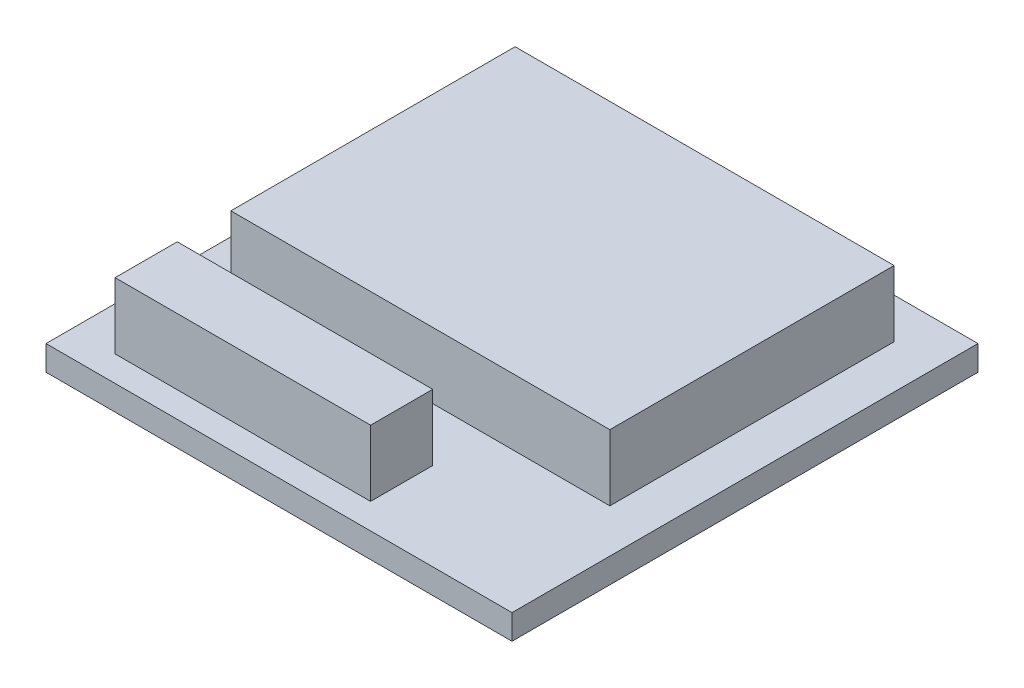
ISO-10303-21;
HEADER;
FILE_DESCRIPTION(('STEP AP214'),'2;1');
FILE_NAME('part.step','',(''),(''),'','','');
FILE_SCHEMA(('AUTOMOTIVE_DESIGN { 1 0 10303 214 1 1 1 1 }'));
ENDSEC;
DATA;
#1=APPLICATION_CONTEXT('core data for automotive mechanical design processes');
#2=APPLICATION_PROTOCOL_DEFINITION('international standard','automotive_design',2000,#1);
#3=PRODUCT_CONTEXT('',#1,'mechanical');
#4=PRODUCT('Part','Part','',(#3));
#5=PRODUCT_RELATED_PRODUCT_CATEGORY('part','',(#4));
#6=PRODUCT_DEFINITION_FORMATION('','',#4);
#7=PRODUCT_DEFINITION_CONTEXT('part definition',#1,'design');
#8=PRODUCT_DEFINITION('design','',#6,#7);
#9=PRODUCT_DEFINITION_SHAPE('','',#8);
#10=(LENGTH_UNIT() NAMED_UNIT(*) SI_UNIT(.MILLI.,.METRE.));
#11=(NAMED_UNIT(*) PLANE_ANGLE_UNIT() SI_UNIT($,.RADIAN.));
#12=(NAMED_UNIT(*) SI_UNIT($,.STERADIAN.) SOLID_ANGLE_UNIT());
#13=UNCERTAINTY_MEASURE_WITH_UNIT(LENGTH_MEASURE(1.E-05),#10,'distance_accuracy_value','');
#14=(GEOMETRIC_REPRESENTATION_CONTEXT(3) GLOBAL_UNCERTAINTY_ASSIGNED_CONTEXT((#13)) GLOBAL_UNIT_ASSIGNED_CONTEXT((#10,
#11,#12)) REPRESENTATION_CONTEXT('',''));
#15=CARTESIAN_POINT('',(0.,0.,0.));
#16=DIRECTION('',(0.,0.,1.));
#17=DIRECTION('',(1.,0.,0.));
#18=AXIS2_PLACEMENT_3D('',#15,#16,#17);
#19=CARTESIAN_POINT('',(2.15841157418595,2.9718,6.78293654824832));
#20=DIRECTION('',(-1.,0.,0.));
#21=DIRECTION('',(0.,0.,1.));
#22=AXIS2_PLACEMENT_3D('',#19,#20,#21);
#23=PLANE('',#22);
#24=DIRECTION('',(0.,0.,-1.));
#25=VECTOR('',#24,1.);
#26=CARTESIAN_POINT('',(2.15841157418595,0.8128,6.78293654824832));
#27=LINE('',#26,#25);
#28=CARTESIAN_POINT('',(2.15841157418595,0.8128,6.78293654824832));
#29=VERTEX_POINT('',#28);
#30=CARTESIAN_POINT('',(2.15841157418595,0.8128,4.75093654824832));
#31=VERTEX_POINT('',#30);
#32=EDGE_CURVE('E109',#29,#31,#27,.T.);
#33=ORIENTED_EDGE('',*,*,#32,.T.);
#34=DIRECTION('',(0.,-1.,0.));
#35=VECTOR('',#34,1.);
#36=CARTESIAN_POINT('',(2.15841157418595,2.9718,4.75093654824832));
#37=LINE('',#36,#35);
#38=CARTESIAN_POINT('',(2.15841157418595,2.9718,4.75093654824832));
#39=VERTEX_POINT('',#38);
#40=EDGE_CURVE('E12',#39,#31,#37,.T.);
#41=ORIENTED_EDGE('',*,*,#40,.F.);
#42=DIRECTION('',(0.,0.,-1.));
#43=VECTOR('',#42,1.);
#44=CARTESIAN_POINT('',(2.15841157418595,2.9718,6.78293654824832));
#45=LINE('',#44,#43);
#46=CARTESIAN_POINT('',(2.15841157418595,2.9718,6.78293654824832));
#47=VERTEX_POINT('',#46);
#48=EDGE_CURVE('E97',#47,#39,#45,.T.);
#49=ORIENTED_EDGE('',*,*,#48,.F.);
#50=DIRECTION('',(0.,-1.,0.));
#51=VECTOR('',#50,1.);
#52=CARTESIAN_POINT('',(2.15841157418595,2.9718,6.78293654824832));
#53=LINE('',#52,#51);
#54=EDGE_CURVE('E105',#47,#29,#53,.T.);
#55=ORIENTED_EDGE('',*,*,#54,.T.);
#56=EDGE_LOOP('',(#33,#41,#49,#55));
#57=FACE_BOUND('',#56,.T.);
#58=ADVANCED_FACE('F46',(#57),#23,.F.);
#59=CARTESIAN_POINT('',(-6.1976,2.9718,4.75093654824832));
#60=DIRECTION('',(0.,0.,1.));
#61=DIRECTION('',(1.,0.,0.));
#62=AXIS2_PLACEMENT_3D('',#59,#60,#61);
#63=PLANE('',#62);
#64=DIRECTION('',(-1.,0.,0.));
#65=VECTOR('',#64,1.);
#66=CARTESIAN_POINT('',(-6.1976,0.8128,4.75093654824832));
#67=LINE('',#66,#65);
#68=CARTESIAN_POINT('',(-6.1976,0.8128,4.75093654824832));
#69=VERTEX_POINT('',#68);
#70=EDGE_CURVE('E101',#31,#69,#67,.T.);
#71=ORIENTED_EDGE('',*,*,#70,.T.);
#72=DIRECTION('',(0.,-1.,0.));
#73=VECTOR('',#72,1.);
#74=CARTESIAN_POINT('',(-6.1976,2.9718,4.75093654824832));
#75=LINE('',#74,#73);
#76=CARTESIAN_POINT('',(-6.1976,2.9718,4.75093654824832));
#77=VERTEX_POINT('',#76);
#78=EDGE_CURVE('E54',#77,#69,#75,.T.);
#79=ORIENTED_EDGE('',*,*,#78,.F.);
#80=DIRECTION('',(-1.,0.,0.));
#81=VECTOR('',#80,1.);
#82=CARTESIAN_POINT('',(-6.1976,2.9718,4.75093654824832));
#83=LINE('',#82,#81);
#84=EDGE_CURVE('E92',#39,#77,#83,.T.);
#85=ORIENTED_EDGE('',*,*,#84,.F.);
#86=ORIENTED_EDGE('',*,*,#40,.T.);
#87=EDGE_LOOP('',(#71,#79,#85,#86));
#88=FACE_BOUND('',#87,.T.);
#89=ADVANCED_FACE('F100',(#88),#63,.F.);
#90=CARTESIAN_POINT('',(-6.1976,2.9718,6.78293654824832));
#91=DIRECTION('',(1.,0.,0.));
#92=DIRECTION('',(0.,0.,-1.));
#93=AXIS2_PLACEMENT_3D('',#90,#91,#92);
#94=PLANE('',#93);
#95=DIRECTION('',(0.,0.,1.));
#96=VECTOR('',#95,1.);
#97=CARTESIAN_POINT('',(-6.1976,0.8128,6.78293654824832));
#98=LINE('',#97,#96);
#99=CARTESIAN_POINT('',(-6.1976,0.8128,6.78293654824832));
#100=VERTEX_POINT('',#99);
#101=EDGE_CURVE('E79',#69,#100,#98,.T.);
#102=ORIENTED_EDGE('',*,*,#101,.T.);
#103=DIRECTION('',(0.,-1.,0.));
#104=VECTOR('',#103,1.);
#105=CARTESIAN_POINT('',(-6.1976,2.9718,6.78293654824832));
#106=LINE('',#105,#104);
#107=CARTESIAN_POINT('',(-6.1976,2.9718,6.78293654824832));
#108=VERTEX_POINT('',#107);
#109=EDGE_CURVE('E102',#108,#100,#106,.T.);
#110=ORIENTED_EDGE('',*,*,#109,.F.);
#111=DIRECTION('',(0.,0.,1.));
#112=VECTOR('',#111,1.);
#113=CARTESIAN_POINT('',(-6.1976,2.9718,6.78293654824832));
#114=LINE('',#113,#112);
#115=EDGE_CURVE('E95',#77,#108,#114,.T.);
#116=ORIENTED_EDGE('',*,*,#115,.F.);
#117=ORIENTED_EDGE('',*,*,#78,.T.);
#118=EDGE_LOOP('',(#102,#110,#116,#117));
#119=FACE_BOUND('',#118,.T.);
#120=ADVANCED_FACE('F103',(#119),#94,.F.);
#121=CARTESIAN_POINT('',(-6.1976,2.9718,6.78293654824832));
#122=DIRECTION('',(0.,0.,-1.));
#123=DIRECTION('',(-1.,0.,0.));
#124=AXIS2_PLACEMENT_3D('',#121,#122,#123);
#125=PLANE('',#124);
#126=DIRECTION('',(1.,0.,0.));
#127=VECTOR('',#126,1.);
#128=CARTESIAN_POINT('',(-6.1976,0.8128,6.78293654824832));
#129=LINE('',#128,#127);
#130=EDGE_CURVE('E85',#100,#29,#129,.T.);
#131=ORIENTED_EDGE('',*,*,#130,.T.);
#132=ORIENTED_EDGE('',*,*,#54,.F.);
#133=DIRECTION('',(1.,0.,0.));
#134=VECTOR('',#133,1.);
#135=CARTESIAN_POINT('',(-6.1976,2.9718,6.78293654824832));
#136=LINE('',#135,#134);
#137=EDGE_CURVE('E62',#108,#47,#136,.T.);
#138=ORIENTED_EDGE('',*,*,#137,.F.);
#139=ORIENTED_EDGE('',*,*,#109,.T.);
#140=EDGE_LOOP('',(#131,#132,#138,#139));
#141=FACE_BOUND('',#140,.T.);
#142=ADVANCED_FACE('F116',(#141),#125,.F.);
#143=CARTESIAN_POINT('',(2.15841157418595,2.9718,4.75093654824832));
#144=DIRECTION('',(0.,-1.,0.));
#145=DIRECTION('',(0.,0.,-1.));
#146=AXIS2_PLACEMENT_3D('',#143,#144,#145);
#147=PLANE('',#146);
#148=ORIENTED_EDGE('',*,*,#48,.T.);
#149=ORIENTED_EDGE('',*,*,#84,.T.);
#150=ORIENTED_EDGE('',*,*,#115,.T.);
#151=ORIENTED_EDGE('',*,*,#137,.T.);
#152=EDGE_LOOP('',(#148,#149,#150,#151));
#153=FACE_BOUND('',#152,.T.);
#154=ADVANCED_FACE('F93',(#153),#147,.F.);
#155=CARTESIAN_POINT('',(2.15841157418595,0.8128,4.75093654824832));
#156=DIRECTION('',(0.,-1.,0.));
#157=DIRECTION('',(0.,0.,-1.));
#158=AXIS2_PLACEMENT_3D('',#155,#156,#157);
#159=PLANE('',#158);
#160=ORIENTED_EDGE('',*,*,#32,.F.);
#161=ORIENTED_EDGE('',*,*,#130,.F.);
#162=ORIENTED_EDGE('',*,*,#101,.F.);
#163=ORIENTED_EDGE('',*,*,#70,.F.);
#164=EDGE_LOOP('',(#160,#161,#162,#163));
#165=FACE_BOUND('',#164,.T.);
#166=ADVANCED_FACE('F119',(#165),#159,.T.);
#167=CLOSED_SHELL('',(#58,#89,#120,#142,#154,#166));
#168=MANIFOLD_SOLID_BREP('B2',#167);
#169=CARTESIAN_POINT('',(6.1976,2.9718,-6.2992));
#170=DIRECTION('',(-1.,0.,0.));
#171=DIRECTION('',(0.,0.,1.));
#172=AXIS2_PLACEMENT_3D('',#169,#170,#171);
#173=PLANE('',#172);
#174=DIRECTION('',(0.,0.,-1.));
#175=VECTOR('',#174,1.);
#176=CARTESIAN_POINT('',(6.1976,0.8128,-6.2992));
#177=LINE('',#176,#175);
#178=CARTESIAN_POINT('',(6.1976,0.8128,2.9972));
#179=VERTEX_POINT('',#178);
#180=CARTESIAN_POINT('',(6.1976,0.8128,-6.2992));
#181=VERTEX_POINT('',#180);
#182=EDGE_CURVE('E252',#179,#181,#177,.T.);
#183=ORIENTED_EDGE('',*,*,#182,.T.);
#184=DIRECTION('',(0.,-1.,0.));
#185=VECTOR('',#184,1.);
#186=CARTESIAN_POINT('',(6.1976,2.9718,-6.2992));
#187=LINE('',#186,#185);
#188=CARTESIAN_POINT('',(6.1976,2.9718,-6.2992));
#189=VERTEX_POINT('',#188);
#190=EDGE_CURVE('E44',#189,#181,#187,.T.);
#191=ORIENTED_EDGE('',*,*,#190,.F.);
#192=DIRECTION('',(0.,0.,-1.));
#193=VECTOR('',#192,1.);
#194=CARTESIAN_POINT('',(6.1976,2.9718,-6.2992));
#195=LINE('',#194,#193);
#196=CARTESIAN_POINT('',(6.1976,2.9718,2.9972));
#197=VERTEX_POINT('',#196);
#198=EDGE_CURVE('E240',#197,#189,#195,.T.);
#199=ORIENTED_EDGE('',*,*,#198,.F.);
#200=DIRECTION('',(0.,-1.,0.));
#201=VECTOR('',#200,1.);
#202=CARTESIAN_POINT('',(6.1976,2.9718,2.9972));
#203=LINE('',#202,#201);
#204=EDGE_CURVE('E248',#197,#179,#203,.T.);
#205=ORIENTED_EDGE('',*,*,#204,.T.);
#206=EDGE_LOOP('',(#183,#191,#199,#205));
#207=FACE_BOUND('',#206,.T.);
#208=ADVANCED_FACE('F189',(#207),#173,.F.);
#209=CARTESIAN_POINT('',(-6.1976,2.9718,-6.2992));
#210=DIRECTION('',(0.,0.,1.));
#211=DIRECTION('',(1.,0.,0.));
#212=AXIS2_PLACEMENT_3D('',#209,#210,#211);
#213=PLANE('',#212);
#214=DIRECTION('',(-1.,0.,0.));
#215=VECTOR('',#214,1.);
#216=CARTESIAN_POINT('',(-6.1976,0.8128,-6.2992));
#217=LINE('',#216,#215);
#218=CARTESIAN_POINT('',(-6.1976,0.8128,-6.2992));
#219=VERTEX_POINT('',#218);
#220=EDGE_CURVE('E244',#181,#219,#217,.T.);
#221=ORIENTED_EDGE('',*,*,#220,.T.);
#222=DIRECTION('',(0.,-1.,0.));
#223=VECTOR('',#222,1.);
#224=CARTESIAN_POINT('',(-6.1976,2.9718,-6.2992));
#225=LINE('',#224,#223);
#226=CARTESIAN_POINT('',(-6.1976,2.9718,-6.2992));
#227=VERTEX_POINT('',#226);
#228=EDGE_CURVE('E197',#227,#219,#225,.T.);
#229=ORIENTED_EDGE('',*,*,#228,.F.);
#230=DIRECTION('',(-1.,0.,0.));
#231=VECTOR('',#230,1.);
#232=CARTESIAN_POINT('',(-6.1976,2.9718,-6.2992));
#233=LINE('',#232,#231);
#234=EDGE_CURVE('E235',#189,#227,#233,.T.);
#235=ORIENTED_EDGE('',*,*,#234,.F.);
#236=ORIENTED_EDGE('',*,*,#190,.T.);
#237=EDGE_LOOP('',(#221,#229,#235,#236));
#238=FACE_BOUND('',#237,.T.);
#239=ADVANCED_FACE('F243',(#238),#213,.F.);
#240=CARTESIAN_POINT('',(-6.1976,2.9718,-6.2992));
#241=DIRECTION('',(1.,0.,0.));
#242=DIRECTION('',(0.,0.,-1.));
#243=AXIS2_PLACEMENT_3D('',#240,#241,#242);
#244=PLANE('',#243);
#245=DIRECTION('',(0.,0.,1.));
#246=VECTOR('',#245,1.);
#247=CARTESIAN_POINT('',(-6.1976,0.8128,-6.2992));
#248=LINE('',#247,#246);
#249=CARTESIAN_POINT('',(-6.1976,0.8128,2.9972));
#250=VERTEX_POINT('',#249);
#251=EDGE_CURVE('E222',#219,#250,#248,.T.);
#252=ORIENTED_EDGE('',*,*,#251,.T.);
#253=DIRECTION('',(0.,-1.,0.));
#254=VECTOR('',#253,1.);
#255=CARTESIAN_POINT('',(-6.1976,2.9718,2.9972));
#256=LINE('',#255,#254);
#257=CARTESIAN_POINT('',(-6.1976,2.9718,2.9972));
#258=VERTEX_POINT('',#257);
#259=EDGE_CURVE('E245',#258,#250,#256,.T.);
#260=ORIENTED_EDGE('',*,*,#259,.F.);
#261=DIRECTION('',(0.,0.,1.));
#262=VECTOR('',#261,1.);
#263=CARTESIAN_POINT('',(-6.1976,2.9718,-6.2992));
#264=LINE('',#263,#262);
#265=EDGE_CURVE('E238',#227,#258,#264,.T.);
#266=ORIENTED_EDGE('',*,*,#265,.F.);
#267=ORIENTED_EDGE('',*,*,#228,.T.);
#268=EDGE_LOOP('',(#252,#260,#266,#267));
#269=FACE_BOUND('',#268,.T.);
#270=ADVANCED_FACE('F246',(#269),#244,.F.);
#271=CARTESIAN_POINT('',(-6.1976,2.9718,2.9972));
#272=DIRECTION('',(0.,0.,-1.));
#273=DIRECTION('',(-1.,0.,0.));
#274=AXIS2_PLACEMENT_3D('',#271,#272,#273);
#275=PLANE('',#274);
#276=DIRECTION('',(1.,0.,0.));
#277=VECTOR('',#276,1.);
#278=CARTESIAN_POINT('',(-6.1976,0.8128,2.9972));
#279=LINE('',#278,#277);
#280=EDGE_CURVE('E228',#250,#179,#279,.T.);
#281=ORIENTED_EDGE('',*,*,#280,.T.);
#282=ORIENTED_EDGE('',*,*,#204,.F.);
#283=DIRECTION('',(1.,0.,0.));
#284=VECTOR('',#283,1.);
#285=CARTESIAN_POINT('',(-6.1976,2.9718,2.9972));
#286=LINE('',#285,#284);
#287=EDGE_CURVE('E205',#258,#197,#286,.T.);
#288=ORIENTED_EDGE('',*,*,#287,.F.);
#289=ORIENTED_EDGE('',*,*,#259,.T.);
#290=EDGE_LOOP('',(#281,#282,#288,#289));
#291=FACE_BOUND('',#290,.T.);
#292=ADVANCED_FACE('F259',(#291),#275,.F.);
#293=CARTESIAN_POINT('',(6.1976,2.9718,2.9972));
#294=DIRECTION('',(0.,1.,0.));
#295=DIRECTION('',(0.,0.,1.));
#296=AXIS2_PLACEMENT_3D('',#293,#294,#295);
#297=PLANE('',#296);
#298=ORIENTED_EDGE('',*,*,#198,.T.);
#299=ORIENTED_EDGE('',*,*,#234,.T.);
#300=ORIENTED_EDGE('',*,*,#265,.T.);
#301=ORIENTED_EDGE('',*,*,#287,.T.);
#302=EDGE_LOOP('',(#298,#299,#300,#301));
#303=FACE_BOUND('',#302,.T.);
#304=ADVANCED_FACE('F236',(#303),#297,.T.);
#305=CARTESIAN_POINT('',(6.1976,0.8128,2.9972));
#306=DIRECTION('',(0.,1.,0.));
#307=DIRECTION('',(0.,0.,1.));
#308=AXIS2_PLACEMENT_3D('',#305,#306,#307);
#309=PLANE('',#308);
#310=ORIENTED_EDGE('',*,*,#182,.F.);
#311=ORIENTED_EDGE('',*,*,#280,.F.);
#312=ORIENTED_EDGE('',*,*,#251,.F.);
#313=ORIENTED_EDGE('',*,*,#220,.F.);
#314=EDGE_LOOP('',(#310,#311,#312,#313));
#315=FACE_BOUND('',#314,.T.);
#316=ADVANCED_FACE('F262',(#315),#309,.F.);
#317=CLOSED_SHELL('',(#208,#239,#270,#292,#304,#316));
#318=MANIFOLD_SOLID_BREP('B6',#317);
#319=CARTESIAN_POINT('',(7.62,0.8128,7.62));
#320=DIRECTION('',(-1.,0.,0.));
#321=DIRECTION('',(0.,0.,1.));
#322=AXIS2_PLACEMENT_3D('',#319,#320,#321);
#323=PLANE('',#322);
#324=DIRECTION('',(0.,0.,-1.));
#325=VECTOR('',#324,1.);
#326=CARTESIAN_POINT('',(7.62,0.,7.62));
#327=LINE('',#326,#325);
#328=CARTESIAN_POINT('',(7.62,0.,7.62));
#329=VERTEX_POINT('',#328);
#330=CARTESIAN_POINT('',(7.62,0.,-7.62));
#331=VERTEX_POINT('',#330);
#332=EDGE_CURVE('E386',#329,#331,#327,.T.);
#333=ORIENTED_EDGE('',*,*,#332,.T.);
#334=DIRECTION('',(0.,-1.,0.));
#335=VECTOR('',#334,1.);
#336=CARTESIAN_POINT('',(7.62,0.8128,-7.62));
#337=LINE('',#336,#335);
#338=CARTESIAN_POINT('',(7.62,0.8128,-7.62));
#339=VERTEX_POINT('',#338);
#340=EDGE_CURVE('E187',#339,#331,#337,.T.);
#341=ORIENTED_EDGE('',*,*,#340,.F.);
#342=DIRECTION('',(0.,0.,-1.));
#343=VECTOR('',#342,1.);
#344=CARTESIAN_POINT('',(7.62,0.8128,7.62));
#345=LINE('',#344,#343);
#346=CARTESIAN_POINT('',(7.62,0.8128,7.62));
#347=VERTEX_POINT('',#346);
#348=EDGE_CURVE('E374',#347,#339,#345,.T.);
#349=ORIENTED_EDGE('',*,*,#348,.F.);
#350=DIRECTION('',(0.,-1.,0.));
#351=VECTOR('',#350,1.);
#352=CARTESIAN_POINT('',(7.62,0.8128,7.62));
#353=LINE('',#352,#351);
#354=EDGE_CURVE('E382',#347,#329,#353,.T.);
#355=ORIENTED_EDGE('',*,*,#354,.T.);
#356=EDGE_LOOP('',(#333,#341,#349,#355));
#357=FACE_BOUND('',#356,.T.);
#358=ADVANCED_FACE('F323',(#357),#323,.F.);
#359=CARTESIAN_POINT('',(-7.62,0.8128,-7.62));
#360=DIRECTION('',(0.,0.,1.));
#361=DIRECTION('',(1.,0.,0.));
#362=AXIS2_PLACEMENT_3D('',#359,#360,#361);
#363=PLANE('',#362);
#364=DIRECTION('',(-1.,0.,0.));
#365=VECTOR('',#364,1.);
#366=CARTESIAN_POINT('',(-7.62,0.,-7.62));
#367=LINE('',#366,#365);
#368=CARTESIAN_POINT('',(-7.62,0.,-7.62));
#369=VERTEX_POINT('',#368);
#370=EDGE_CURVE('E378',#331,#369,#367,.T.);
#371=ORIENTED_EDGE('',*,*,#370,.T.);
#372=DIRECTION('',(0.,-1.,0.));
#373=VECTOR('',#372,1.);
#374=CARTESIAN_POINT('',(-7.62,0.8128,-7.62));
#375=LINE('',#374,#373);
#376=CARTESIAN_POINT('',(-7.62,0.8128,-7.62));
#377=VERTEX_POINT('',#376);
#378=EDGE_CURVE('E331',#377,#369,#375,.T.);
#379=ORIENTED_EDGE('',*,*,#378,.F.);
#380=DIRECTION('',(-1.,0.,0.));
#381=VECTOR('',#380,1.);
#382=CARTESIAN_POINT('',(-7.62,0.8128,-7.62));
#383=LINE('',#382,#381);
#384=EDGE_CURVE('E369',#339,#377,#383,.T.);
#385=ORIENTED_EDGE('',*,*,#384,.F.);
#386=ORIENTED_EDGE('',*,*,#340,.T.);
#387=EDGE_LOOP('',(#371,#379,#385,#386));
#388=FACE_BOUND('',#387,.T.);
#389=ADVANCED_FACE('F377',(#388),#363,.F.);
#390=CARTESIAN_POINT('',(-7.62,0.8128,7.62));
#391=DIRECTION('',(1.,0.,0.));
#392=DIRECTION('',(0.,0.,-1.));
#393=AXIS2_PLACEMENT_3D('',#390,#391,#392);
#394=PLANE('',#393);
#395=DIRECTION('',(0.,0.,1.));
#396=VECTOR('',#395,1.);
#397=CARTESIAN_POINT('',(-7.62,0.,7.62));
#398=LINE('',#397,#396);
#399=CARTESIAN_POINT('',(-7.62,0.,7.62));
#400=VERTEX_POINT('',#399);
#401=EDGE_CURVE('E356',#369,#400,#398,.T.);
#402=ORIENTED_EDGE('',*,*,#401,.T.);
#403=DIRECTION('',(0.,-1.,0.));
#404=VECTOR('',#403,1.);
#405=CARTESIAN_POINT('',(-7.62,0.8128,7.62));
#406=LINE('',#405,#404);
#407=CARTESIAN_POINT('',(-7.62,0.8128,7.62));
#408=VERTEX_POINT('',#407);
#409=EDGE_CURVE('E379',#408,#400,#406,.T.);
#410=ORIENTED_EDGE('',*,*,#409,.F.);
#411=DIRECTION('',(0.,0.,1.));
#412=VECTOR('',#411,1.);
#413=CARTESIAN_POINT('',(-7.62,0.8128,7.62));
#414=LINE('',#413,#412);
#415=EDGE_CURVE('E372',#377,#408,#414,.T.);
#416=ORIENTED_EDGE('',*,*,#415,.F.);
#417=ORIENTED_EDGE('',*,*,#378,.T.);
#418=EDGE_LOOP('',(#402,#410,#416,#417));
#419=FACE_BOUND('',#418,.T.);
#420=ADVANCED_FACE('F380',(#419),#394,.F.);
#421=CARTESIAN_POINT('',(-7.62,0.8128,7.62));
#422=DIRECTION('',(0.,0.,-1.));
#423=DIRECTION('',(-1.,0.,0.));
#424=AXIS2_PLACEMENT_3D('',#421,#422,#423);
#425=PLANE('',#424);
#426=DIRECTION('',(1.,0.,0.));
#427=VECTOR('',#426,1.);
#428=CARTESIAN_POINT('',(-7.62,0.,7.62));
#429=LINE('',#428,#427);
#430=EDGE_CURVE('E362',#400,#329,#429,.T.);
#431=ORIENTED_EDGE('',*,*,#430,.T.);
#432=ORIENTED_EDGE('',*,*,#354,.F.);
#433=DIRECTION('',(1.,0.,0.));
#434=VECTOR('',#433,1.);
#435=CARTESIAN_POINT('',(-7.62,0.8128,7.62));
#436=LINE('',#435,#434);
#437=EDGE_CURVE('E339',#408,#347,#436,.T.);
#438=ORIENTED_EDGE('',*,*,#437,.F.);
#439=ORIENTED_EDGE('',*,*,#409,.T.);
#440=EDGE_LOOP('',(#431,#432,#438,#439));
#441=FACE_BOUND('',#440,.T.);
#442=ADVANCED_FACE('F393',(#441),#425,.F.);
#443=CARTESIAN_POINT('',(7.62,0.8128,-7.62));
#444=DIRECTION('',(0.,-1.,0.));
#445=DIRECTION('',(0.,0.,-1.));
#446=AXIS2_PLACEMENT_3D('',#443,#444,#445);
#447=PLANE('',#446);
#448=ORIENTED_EDGE('',*,*,#348,.T.);
#449=ORIENTED_EDGE('',*,*,#384,.T.);
#450=ORIENTED_EDGE('',*,*,#415,.T.);
#451=ORIENTED_EDGE('',*,*,#437,.T.);
#452=EDGE_LOOP('',(#448,#449,#450,#451));
#453=FACE_BOUND('',#452,.T.);
#454=ADVANCED_FACE('F370',(#453),#447,.F.);
#455=CARTESIAN_POINT('',(7.62,0.,-7.62));
#456=DIRECTION('',(0.,-1.,0.));
#457=DIRECTION('',(0.,0.,-1.));
#458=AXIS2_PLACEMENT_3D('',#455,#456,#457);
#459=PLANE('',#458);
#460=ORIENTED_EDGE('',*,*,#332,.F.);
#461=ORIENTED_EDGE('',*,*,#430,.F.);
#462=ORIENTED_EDGE('',*,*,#401,.F.);
#463=ORIENTED_EDGE('',*,*,#370,.F.);
#464=EDGE_LOOP('',(#460,#461,#462,#463));
#465=FACE_BOUND('',#464,.T.);
#466=ADVANCED_FACE('F396',(#465),#459,.T.);
#467=CLOSED_SHELL('',(#358,#389,#420,#442,#454,#466));
#468=MANIFOLD_SOLID_BREP('B38',#467);
#469=ADVANCED_BREP_SHAPE_REPRESENTATION('',(#18,#168,#318,#468),#14);
#470=SHAPE_DEFINITION_REPRESENTATION(#9,#469);
ENDSEC;
END-ISO-10303-21;
